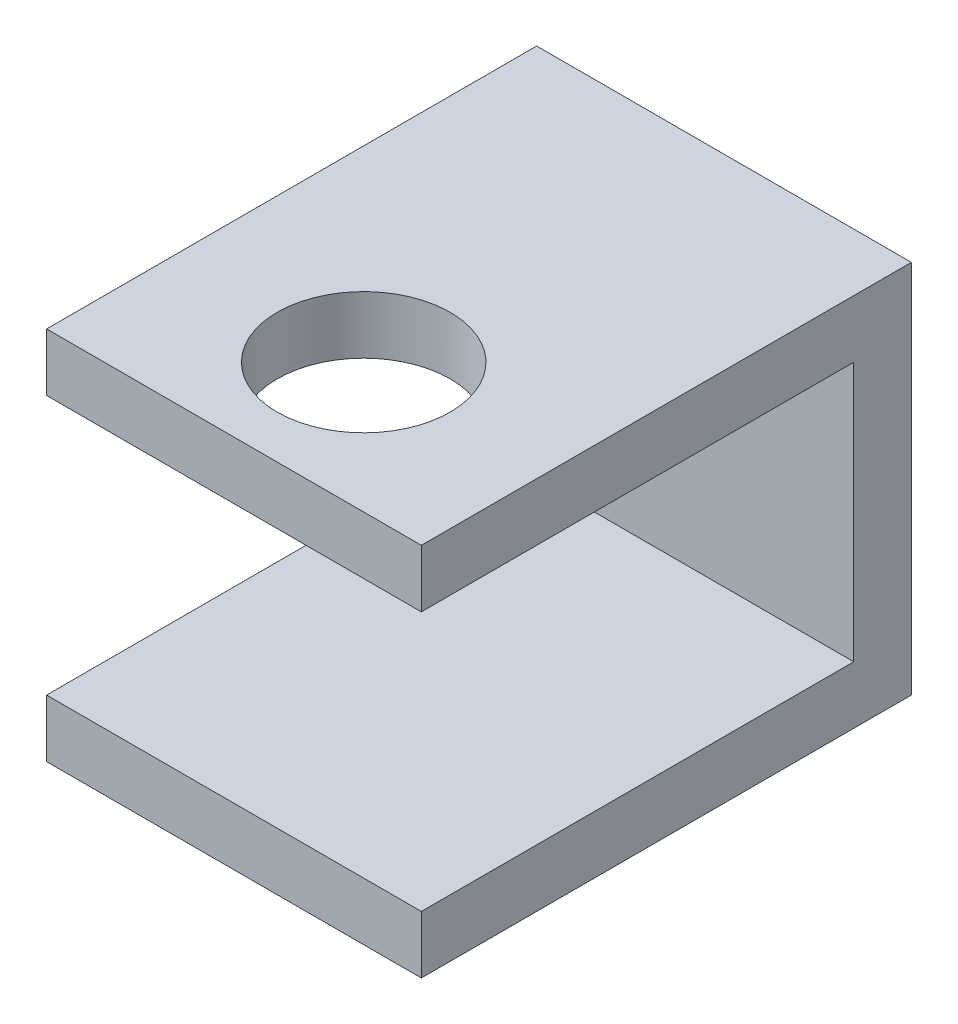
ISO-10303-21;
HEADER;
FILE_DESCRIPTION(('STEP AP214'),'2;1');
FILE_NAME('part.step','',(''),(''),'','','');
FILE_SCHEMA(('AUTOMOTIVE_DESIGN { 1 0 10303 214 1 1 1 1 }'));
ENDSEC;
DATA;
#1=APPLICATION_CONTEXT('core data for automotive mechanical design processes');
#2=APPLICATION_PROTOCOL_DEFINITION('international standard','automotive_design',2000,#1);
#3=PRODUCT_CONTEXT('',#1,'mechanical');
#4=PRODUCT('Part','Part','',(#3));
#5=PRODUCT_RELATED_PRODUCT_CATEGORY('part','',(#4));
#6=PRODUCT_DEFINITION_FORMATION('','',#4);
#7=PRODUCT_DEFINITION_CONTEXT('part definition',#1,'design');
#8=PRODUCT_DEFINITION('design','',#6,#7);
#9=PRODUCT_DEFINITION_SHAPE('','',#8);
#10=(LENGTH_UNIT() NAMED_UNIT(*) SI_UNIT(.MILLI.,.METRE.));
#11=(NAMED_UNIT(*) PLANE_ANGLE_UNIT() SI_UNIT($,.RADIAN.));
#12=(NAMED_UNIT(*) SI_UNIT($,.STERADIAN.) SOLID_ANGLE_UNIT());
#13=UNCERTAINTY_MEASURE_WITH_UNIT(LENGTH_MEASURE(1.E-05),#10,'distance_accuracy_value','');
#14=(GEOMETRIC_REPRESENTATION_CONTEXT(3) GLOBAL_UNCERTAINTY_ASSIGNED_CONTEXT((#13)) GLOBAL_UNIT_ASSIGNED_CONTEXT((#10,
#11,#12)) REPRESENTATION_CONTEXT('',''));
#15=CARTESIAN_POINT('',(0.,0.,0.));
#16=DIRECTION('',(0.,0.,1.));
#17=DIRECTION('',(1.,0.,0.));
#18=AXIS2_PLACEMENT_3D('',#15,#16,#17);
#19=CARTESIAN_POINT('',(0.,0.,0.2));
#20=DIRECTION('',(0.,0.,-1.));
#21=DIRECTION('',(-1.,0.,0.));
#22=AXIS2_PLACEMENT_3D('',#19,#20,#21);
#23=PLANE('',#22);
#24=DIRECTION('',(-1.,0.,0.));
#25=VECTOR('',#24,1.);
#26=CARTESIAN_POINT('',(0.,0.2,0.2));
#27=LINE('',#26,#25);
#28=CARTESIAN_POINT('',(1.3,0.2,0.2));
#29=VERTEX_POINT('',#28);
#30=CARTESIAN_POINT('',(0.,0.2,0.2));
#31=VERTEX_POINT('',#30);
#32=EDGE_CURVE('E11',#29,#31,#27,.T.);
#33=ORIENTED_EDGE('',*,*,#32,.F.);
#34=DIRECTION('',(0.,-1.,0.));
#35=VECTOR('',#34,1.);
#36=CARTESIAN_POINT('',(1.3,1.3,0.2));
#37=LINE('',#36,#35);
#38=CARTESIAN_POINT('',(1.3,1.1,0.2));
#39=VERTEX_POINT('',#38);
#40=EDGE_CURVE('E124',#39,#29,#37,.T.);
#41=ORIENTED_EDGE('',*,*,#40,.F.);
#42=DIRECTION('',(1.,0.,0.));
#43=VECTOR('',#42,1.);
#44=CARTESIAN_POINT('',(0.,1.1,0.2));
#45=LINE('',#44,#43);
#46=CARTESIAN_POINT('',(0.,1.1,0.2));
#47=VERTEX_POINT('',#46);
#48=EDGE_CURVE('E41',#47,#39,#45,.T.);
#49=ORIENTED_EDGE('',*,*,#48,.F.);
#50=DIRECTION('',(0.,1.,0.));
#51=VECTOR('',#50,1.);
#52=CARTESIAN_POINT('',(0.,1.3,0.2));
#53=LINE('',#52,#51);
#54=EDGE_CURVE('E126',#31,#47,#53,.T.);
#55=ORIENTED_EDGE('',*,*,#54,.F.);
#56=EDGE_LOOP('',(#33,#41,#49,#55));
#57=FACE_BOUND('',#56,.T.);
#58=ADVANCED_FACE('F33',(#57),#23,.F.);
#59=CARTESIAN_POINT('',(0.,1.1,-0.3));
#60=DIRECTION('',(0.,-1.,0.));
#61=DIRECTION('',(0.,0.,-1.));
#62=AXIS2_PLACEMENT_3D('',#59,#60,#61);
#63=PLANE('',#62);
#64=CARTESIAN_POINT('',(0.65,1.1,1.25));
#65=DIRECTION('',(0.,-1.,0.));
#66=DIRECTION('',(0.,0.,-1.));
#67=AXIS2_PLACEMENT_3D('',#64,#65,#66);
#68=CIRCLE('',#67,0.3);
#69=CARTESIAN_POINT('',(0.65,1.1,0.95));
#70=VERTEX_POINT('',#69);
#71=EDGE_CURVE('E137',#70,#70,#68,.T.);
#72=ORIENTED_EDGE('',*,*,#71,.F.);
#73=EDGE_LOOP('',(#72));
#74=FACE_BOUND('',#73,.T.);
#75=DIRECTION('',(0.,0.,1.));
#76=VECTOR('',#75,1.);
#77=CARTESIAN_POINT('',(0.,1.1,-0.3));
#78=LINE('',#77,#76);
#79=CARTESIAN_POINT('',(0.,1.1,1.7));
#80=VERTEX_POINT('',#79);
#81=EDGE_CURVE('E55',#47,#80,#78,.T.);
#82=ORIENTED_EDGE('',*,*,#81,.F.);
#83=ORIENTED_EDGE('',*,*,#48,.T.);
#84=DIRECTION('',(0.,0.,1.));
#85=VECTOR('',#84,1.);
#86=CARTESIAN_POINT('',(1.3,1.1,-0.3));
#87=LINE('',#86,#85);
#88=CARTESIAN_POINT('',(1.3,1.1,1.7));
#89=VERTEX_POINT('',#88);
#90=EDGE_CURVE('E141',#39,#89,#87,.T.);
#91=ORIENTED_EDGE('',*,*,#90,.T.);
#92=DIRECTION('',(1.,0.,0.));
#93=VECTOR('',#92,1.);
#94=CARTESIAN_POINT('',(0.,1.1,1.7));
#95=LINE('',#94,#93);
#96=EDGE_CURVE('E154',#80,#89,#95,.T.);
#97=ORIENTED_EDGE('',*,*,#96,.F.);
#98=EDGE_LOOP('',(#82,#83,#91,#97));
#99=FACE_BOUND('',#98,.T.);
#100=ADVANCED_FACE('F168',(#74,#99),#63,.T.);
#101=CARTESIAN_POINT('',(0.,0.,1.7));
#102=DIRECTION('',(1.,0.,0.));
#103=DIRECTION('',(0.,1.,0.));
#104=AXIS2_PLACEMENT_3D('',#101,#102,#103);
#105=PLANE('',#104);
#106=DIRECTION('',(0.,0.,-1.));
#107=VECTOR('',#106,1.);
#108=CARTESIAN_POINT('',(0.,0.,0.2));
#109=LINE('',#108,#107);
#110=CARTESIAN_POINT('',(0.,0.,1.7));
#111=VERTEX_POINT('',#110);
#112=CARTESIAN_POINT('',(0.,0.,0.));
#113=VERTEX_POINT('',#112);
#114=EDGE_CURVE('E116',#111,#113,#109,.T.);
#115=ORIENTED_EDGE('',*,*,#114,.F.);
#116=DIRECTION('',(0.,-1.,0.));
#117=VECTOR('',#116,1.);
#118=CARTESIAN_POINT('',(0.,0.,1.7));
#119=LINE('',#118,#117);
#120=CARTESIAN_POINT('',(0.,0.2,1.7));
#121=VERTEX_POINT('',#120);
#122=EDGE_CURVE('E110',#121,#111,#119,.T.);
#123=ORIENTED_EDGE('',*,*,#122,.F.);
#124=DIRECTION('',(0.,0.,1.));
#125=VECTOR('',#124,1.);
#126=CARTESIAN_POINT('',(0.,0.2,-0.3));
#127=LINE('',#126,#125);
#128=EDGE_CURVE('E97',#31,#121,#127,.T.);
#129=ORIENTED_EDGE('',*,*,#128,.F.);
#130=ORIENTED_EDGE('',*,*,#54,.T.);
#131=ORIENTED_EDGE('',*,*,#81,.T.);
#132=DIRECTION('',(0.,-1.,0.));
#133=VECTOR('',#132,1.);
#134=CARTESIAN_POINT('',(0.,0.,1.7));
#135=LINE('',#134,#133);
#136=CARTESIAN_POINT('',(0.,1.3,1.7));
#137=VERTEX_POINT('',#136);
#138=EDGE_CURVE('E148',#137,#80,#135,.T.);
#139=ORIENTED_EDGE('',*,*,#138,.F.);
#140=DIRECTION('',(0.,0.,-1.));
#141=VECTOR('',#140,1.);
#142=CARTESIAN_POINT('',(0.,1.3,1.7));
#143=LINE('',#142,#141);
#144=CARTESIAN_POINT('',(0.,1.3,0.));
#145=VERTEX_POINT('',#144);
#146=EDGE_CURVE('E143',#137,#145,#143,.T.);
#147=ORIENTED_EDGE('',*,*,#146,.T.);
#148=DIRECTION('',(0.,-1.,0.));
#149=VECTOR('',#148,1.);
#150=CARTESIAN_POINT('',(0.,0.,0.));
#151=LINE('',#150,#149);
#152=EDGE_CURVE('E145',#145,#113,#151,.T.);
#153=ORIENTED_EDGE('',*,*,#152,.T.);
#154=EDGE_LOOP('',(#115,#123,#129,#130,#131,#139,#147,#153));
#155=FACE_BOUND('',#154,.T.);
#156=ADVANCED_FACE('F35',(#155),#105,.F.);
#157=CARTESIAN_POINT('',(1.3,0.,1.7));
#158=DIRECTION('',(-1.,0.,0.));
#159=DIRECTION('',(0.,-1.,0.));
#160=AXIS2_PLACEMENT_3D('',#157,#158,#159);
#161=PLANE('',#160);
#162=DIRECTION('',(0.,1.,0.));
#163=VECTOR('',#162,1.);
#164=CARTESIAN_POINT('',(1.3,0.,0.));
#165=LINE('',#164,#163);
#166=CARTESIAN_POINT('',(1.3,0.,0.));
#167=VERTEX_POINT('',#166);
#168=CARTESIAN_POINT('',(1.3,1.3,0.));
#169=VERTEX_POINT('',#168);
#170=EDGE_CURVE('E157',#167,#169,#165,.T.);
#171=ORIENTED_EDGE('',*,*,#170,.T.);
#172=DIRECTION('',(0.,0.,-1.));
#173=VECTOR('',#172,1.);
#174=CARTESIAN_POINT('',(1.3,1.3,1.7));
#175=LINE('',#174,#173);
#176=CARTESIAN_POINT('',(1.3,1.3,1.7));
#177=VERTEX_POINT('',#176);
#178=EDGE_CURVE('E138',#177,#169,#175,.T.);
#179=ORIENTED_EDGE('',*,*,#178,.F.);
#180=DIRECTION('',(0.,1.,0.));
#181=VECTOR('',#180,1.);
#182=CARTESIAN_POINT('',(1.3,0.,1.7));
#183=LINE('',#182,#181);
#184=EDGE_CURVE('E151',#89,#177,#183,.T.);
#185=ORIENTED_EDGE('',*,*,#184,.F.);
#186=ORIENTED_EDGE('',*,*,#90,.F.);
#187=ORIENTED_EDGE('',*,*,#40,.T.);
#188=DIRECTION('',(0.,0.,1.));
#189=VECTOR('',#188,1.);
#190=CARTESIAN_POINT('',(1.3,0.2,-0.3));
#191=LINE('',#190,#189);
#192=CARTESIAN_POINT('',(1.3,0.2,1.7));
#193=VERTEX_POINT('',#192);
#194=EDGE_CURVE('E104',#29,#193,#191,.T.);
#195=ORIENTED_EDGE('',*,*,#194,.T.);
#196=DIRECTION('',(0.,1.,0.));
#197=VECTOR('',#196,1.);
#198=CARTESIAN_POINT('',(1.3,0.,1.7));
#199=LINE('',#198,#197);
#200=CARTESIAN_POINT('',(1.3,0.,1.7));
#201=VERTEX_POINT('',#200);
#202=EDGE_CURVE('E113',#201,#193,#199,.T.);
#203=ORIENTED_EDGE('',*,*,#202,.F.);
#204=DIRECTION('',(0.,0.,-1.));
#205=VECTOR('',#204,1.);
#206=CARTESIAN_POINT('',(1.3,0.,0.2));
#207=LINE('',#206,#205);
#208=EDGE_CURVE('E128',#201,#167,#207,.T.);
#209=ORIENTED_EDGE('',*,*,#208,.T.);
#210=EDGE_LOOP('',(#171,#179,#185,#186,#187,#195,#203,#209));
#211=FACE_BOUND('',#210,.T.);
#212=ADVANCED_FACE('F171',(#211),#161,.F.);
#213=CARTESIAN_POINT('',(0.,0.,1.7));
#214=DIRECTION('',(0.,0.,-1.));
#215=DIRECTION('',(-1.,0.,0.));
#216=AXIS2_PLACEMENT_3D('',#213,#214,#215);
#217=PLANE('',#216);
#218=ORIENTED_EDGE('',*,*,#96,.T.);
#219=ORIENTED_EDGE('',*,*,#184,.T.);
#220=DIRECTION('',(-1.,0.,0.));
#221=VECTOR('',#220,1.);
#222=CARTESIAN_POINT('',(0.,1.3,1.7));
#223=LINE('',#222,#221);
#224=EDGE_CURVE('E149',#177,#137,#223,.T.);
#225=ORIENTED_EDGE('',*,*,#224,.T.);
#226=ORIENTED_EDGE('',*,*,#138,.T.);
#227=EDGE_LOOP('',(#218,#219,#225,#226));
#228=FACE_BOUND('',#227,.T.);
#229=ADVANCED_FACE('F175',(#228),#217,.F.);
#230=CARTESIAN_POINT('',(0.,0.,0.));
#231=DIRECTION('',(0.,0.,-1.));
#232=DIRECTION('',(-1.,0.,0.));
#233=AXIS2_PLACEMENT_3D('',#230,#231,#232);
#234=PLANE('',#233);
#235=DIRECTION('',(-1.,0.,0.));
#236=VECTOR('',#235,1.);
#237=CARTESIAN_POINT('',(1.3,0.,0.));
#238=LINE('',#237,#236);
#239=EDGE_CURVE('E123',#167,#113,#238,.T.);
#240=ORIENTED_EDGE('',*,*,#239,.T.);
#241=ORIENTED_EDGE('',*,*,#152,.F.);
#242=DIRECTION('',(-1.,0.,0.));
#243=VECTOR('',#242,1.);
#244=CARTESIAN_POINT('',(0.,1.3,0.));
#245=LINE('',#244,#243);
#246=EDGE_CURVE('E142',#169,#145,#245,.T.);
#247=ORIENTED_EDGE('',*,*,#246,.F.);
#248=ORIENTED_EDGE('',*,*,#170,.F.);
#249=EDGE_LOOP('',(#240,#241,#247,#248));
#250=FACE_BOUND('',#249,.T.);
#251=ADVANCED_FACE('F183',(#250),#234,.T.);
#252=CARTESIAN_POINT('',(0.,1.3,1.7));
#253=DIRECTION('',(0.,-1.,0.));
#254=DIRECTION('',(0.,0.,-1.));
#255=AXIS2_PLACEMENT_3D('',#252,#253,#254);
#256=PLANE('',#255);
#257=ORIENTED_EDGE('',*,*,#246,.T.);
#258=ORIENTED_EDGE('',*,*,#146,.F.);
#259=ORIENTED_EDGE('',*,*,#224,.F.);
#260=ORIENTED_EDGE('',*,*,#178,.T.);
#261=EDGE_LOOP('',(#257,#258,#259,#260));
#262=FACE_BOUND('',#261,.T.);
#263=CARTESIAN_POINT('',(0.65,1.3,1.25));
#264=DIRECTION('',(0.,1.,0.));
#265=DIRECTION('',(0.,0.,1.));
#266=AXIS2_PLACEMENT_3D('',#263,#264,#265);
#267=CIRCLE('',#266,0.3);
#268=CARTESIAN_POINT('',(0.65,1.3,1.55));
#269=VERTEX_POINT('',#268);
#270=EDGE_CURVE('E132',#269,#269,#267,.T.);
#271=ORIENTED_EDGE('',*,*,#270,.F.);
#272=EDGE_LOOP('',(#271));
#273=FACE_BOUND('',#272,.T.);
#274=ADVANCED_FACE('F180',(#262,#273),#256,.F.);
#275=CARTESIAN_POINT('',(0.65,0.,1.25));
#276=DIRECTION('',(0.,1.,0.));
#277=DIRECTION('',(0.,0.,1.));
#278=AXIS2_PLACEMENT_3D('',#275,#276,#277);
#279=CYLINDRICAL_SURFACE('',#278,0.3);
#280=ORIENTED_EDGE('',*,*,#71,.T.);
#281=EDGE_LOOP('',(#280));
#282=FACE_BOUND('',#281,.T.);
#283=ORIENTED_EDGE('',*,*,#270,.T.);
#284=EDGE_LOOP('',(#283));
#285=FACE_BOUND('',#284,.T.);
#286=ADVANCED_FACE('F188',(#282,#285),#279,.F.);
#287=CARTESIAN_POINT('',(1.3,0.,0.2));
#288=DIRECTION('',(0.,-1.,0.));
#289=DIRECTION('',(0.,0.,-1.));
#290=AXIS2_PLACEMENT_3D('',#287,#288,#289);
#291=PLANE('',#290);
#292=ORIENTED_EDGE('',*,*,#239,.F.);
#293=ORIENTED_EDGE('',*,*,#208,.F.);
#294=DIRECTION('',(1.,0.,0.));
#295=VECTOR('',#294,1.);
#296=CARTESIAN_POINT('',(0.,0.,1.7));
#297=LINE('',#296,#295);
#298=EDGE_CURVE('E117',#111,#201,#297,.T.);
#299=ORIENTED_EDGE('',*,*,#298,.F.);
#300=ORIENTED_EDGE('',*,*,#114,.T.);
#301=EDGE_LOOP('',(#292,#293,#299,#300));
#302=FACE_BOUND('',#301,.T.);
#303=ADVANCED_FACE('F186',(#302),#291,.T.);
#304=CARTESIAN_POINT('',(0.,0.2,-0.3));
#305=DIRECTION('',(0.,-1.,0.));
#306=DIRECTION('',(0.,0.,-1.));
#307=AXIS2_PLACEMENT_3D('',#304,#305,#306);
#308=PLANE('',#307);
#309=ORIENTED_EDGE('',*,*,#194,.F.);
#310=ORIENTED_EDGE('',*,*,#32,.T.);
#311=ORIENTED_EDGE('',*,*,#128,.T.);
#312=DIRECTION('',(1.,0.,0.));
#313=VECTOR('',#312,1.);
#314=CARTESIAN_POINT('',(0.,0.2,1.7));
#315=LINE('',#314,#313);
#316=EDGE_CURVE('E101',#121,#193,#315,.T.);
#317=ORIENTED_EDGE('',*,*,#316,.T.);
#318=EDGE_LOOP('',(#309,#310,#311,#317));
#319=FACE_BOUND('',#318,.T.);
#320=ADVANCED_FACE('F100',(#319),#308,.F.);
#321=CARTESIAN_POINT('',(0.,0.,1.7));
#322=DIRECTION('',(0.,0.,-1.));
#323=DIRECTION('',(-1.,0.,0.));
#324=AXIS2_PLACEMENT_3D('',#321,#322,#323);
#325=PLANE('',#324);
#326=ORIENTED_EDGE('',*,*,#202,.T.);
#327=ORIENTED_EDGE('',*,*,#316,.F.);
#328=ORIENTED_EDGE('',*,*,#122,.T.);
#329=ORIENTED_EDGE('',*,*,#298,.T.);
#330=EDGE_LOOP('',(#326,#327,#328,#329));
#331=FACE_BOUND('',#330,.T.);
#332=ADVANCED_FACE('F108',(#331),#325,.F.);
#333=CLOSED_SHELL('',(#58,#100,#156,#212,#229,#251,#274,#286,#303,#320,#332));
#334=MANIFOLD_SOLID_BREP('B2',#333);
#335=ADVANCED_BREP_SHAPE_REPRESENTATION('',(#18,#334),#14);
#336=SHAPE_DEFINITION_REPRESENTATION(#9,#335);
ENDSEC;
END-ISO-10303-21;
